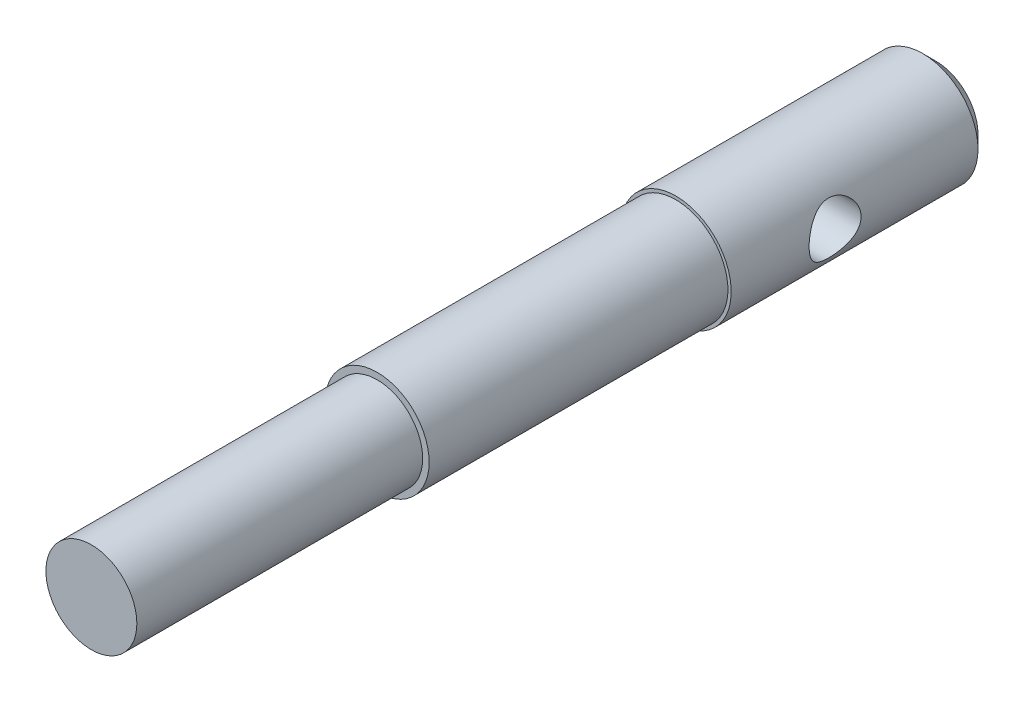
ISO-10303-21;
HEADER;
FILE_DESCRIPTION(('STEP AP214'),'2;1');
FILE_NAME('part.step','',(''),(''),'','','');
FILE_SCHEMA(('AUTOMOTIVE_DESIGN { 1 0 10303 214 1 1 1 1 }'));
ENDSEC;
DATA;
#1=APPLICATION_CONTEXT('core data for automotive mechanical design processes');
#2=APPLICATION_PROTOCOL_DEFINITION('international standard','automotive_design',2000,#1);
#3=PRODUCT_CONTEXT('',#1,'mechanical');
#4=PRODUCT('Part','Part','',(#3));
#5=PRODUCT_RELATED_PRODUCT_CATEGORY('part','',(#4));
#6=PRODUCT_DEFINITION_FORMATION('','',#4);
#7=PRODUCT_DEFINITION_CONTEXT('part definition',#1,'design');
#8=PRODUCT_DEFINITION('design','',#6,#7);
#9=PRODUCT_DEFINITION_SHAPE('','',#8);
#10=(LENGTH_UNIT() NAMED_UNIT(*) SI_UNIT(.MILLI.,.METRE.));
#11=(NAMED_UNIT(*) PLANE_ANGLE_UNIT() SI_UNIT($,.RADIAN.));
#12=(NAMED_UNIT(*) SI_UNIT($,.STERADIAN.) SOLID_ANGLE_UNIT());
#13=UNCERTAINTY_MEASURE_WITH_UNIT(LENGTH_MEASURE(1.E-05),#10,'distance_accuracy_value','');
#14=(GEOMETRIC_REPRESENTATION_CONTEXT(3) GLOBAL_UNCERTAINTY_ASSIGNED_CONTEXT((#13)) GLOBAL_UNIT_ASSIGNED_CONTEXT((#10,
#11,#12)) REPRESENTATION_CONTEXT('',''));
#15=CARTESIAN_POINT('',(0.,0.,0.));
#16=DIRECTION('',(0.,0.,1.));
#17=DIRECTION('',(1.,0.,0.));
#18=AXIS2_PLACEMENT_3D('',#15,#16,#17);
#19=CARTESIAN_POINT('',(0.,0.,65.));
#20=DIRECTION('',(0.,0.,-1.));
#21=DIRECTION('',(-1.,0.,0.));
#22=AXIS2_PLACEMENT_3D('',#19,#20,#21);
#23=CYLINDRICAL_SURFACE('',#22,4.);
#24=CARTESIAN_POINT('',(0.,0.,20.));
#25=DIRECTION('',(0.,0.,-1.));
#26=DIRECTION('',(-1.,0.,0.));
#27=AXIS2_PLACEMENT_3D('',#24,#25,#26);
#28=CIRCLE('',#27,4.);
#29=CARTESIAN_POINT('',(-4.,0.,20.));
#30=VERTEX_POINT('',#29);
#31=EDGE_CURVE('E113',#30,#30,#28,.T.);
#32=ORIENTED_EDGE('',*,*,#31,.F.);
#33=EDGE_LOOP('',(#32));
#34=FACE_BOUND('',#33,.T.);
#35=CARTESIAN_POINT('',(0.,0.,43.));
#36=DIRECTION('',(0.,0.,1.));
#37=DIRECTION('',(1.,0.,0.));
#38=AXIS2_PLACEMENT_3D('',#35,#36,#37);
#39=CIRCLE('',#38,4.);
#40=CARTESIAN_POINT('',(4.,0.,43.));
#41=VERTEX_POINT('',#40);
#42=EDGE_CURVE('E106',#41,#41,#39,.T.);
#43=ORIENTED_EDGE('',*,*,#42,.F.);
#44=EDGE_LOOP('',(#43));
#45=FACE_BOUND('',#44,.T.);
#46=ADVANCED_FACE('F34',(#34,#45),#23,.T.);
#47=CARTESIAN_POINT('',(0.,0.,20.));
#48=DIRECTION('',(0.,0.,-1.));
#49=DIRECTION('',(-1.,0.,0.));
#50=AXIS2_PLACEMENT_3D('',#47,#48,#49);
#51=CYLINDRICAL_SURFACE('',#50,4.25);
#52=CARTESIAN_POINT('',(0.,0.,1.));
#53=DIRECTION('',(0.,0.,1.));
#54=DIRECTION('',(1.,0.,0.));
#55=AXIS2_PLACEMENT_3D('',#52,#53,#54);
#56=CIRCLE('',#55,4.25);
#57=CARTESIAN_POINT('',(4.25,0.,1.));
#58=VERTEX_POINT('',#57);
#59=EDGE_CURVE('E10',#58,#58,#56,.T.);
#60=ORIENTED_EDGE('',*,*,#59,.T.);
#61=EDGE_LOOP('',(#60));
#62=FACE_BOUND('',#61,.T.);
#63=CARTESIAN_POINT('',(-4.25,0.,10.));
#64=CARTESIAN_POINT('',(-4.24999501672173,-0.105871059149561,10.0000059093653));
#65=CARTESIAN_POINT('',(-4.24600055225517,-0.211889826042652,10.0084560386312));
#66=CARTESIAN_POINT('',(-4.23041695023392,-0.420839602880815,10.041904277046));
#67=CARTESIAN_POINT('',(-4.21881125611067,-0.52376336869274,10.0669384623928));
#68=CARTESIAN_POINT('',(-4.18922939752824,-0.723173878337783,10.132384273026));
#69=CARTESIAN_POINT('',(-4.17127698127016,-0.8196830464565,10.1727386142832));
#70=CARTESIAN_POINT('',(-4.13068518172628,-1.0044398223861,10.2674052431119));
#71=CARTESIAN_POINT('',(-4.10804653469598,-1.09268872481146,10.3217153384128));
#72=CARTESIAN_POINT('',(-4.05873967893696,-1.26392455033518,10.4461945540519));
#73=CARTESIAN_POINT('',(-4.03191771501793,-1.3463491186544,10.5170755721965));
#74=CARTESIAN_POINT('',(-3.97782593635649,-1.4986476575487,10.6711645950736));
#75=CARTESIAN_POINT('',(-3.95055583482041,-1.56851321989917,10.7543807906679));
#76=CARTESIAN_POINT('',(-3.89658395161941,-1.69835351712052,10.937452571941));
#77=CARTESIAN_POINT('',(-3.8700409808222,-1.75735961813898,11.0380472339996));
#78=CARTESIAN_POINT('',(-3.82305583598051,-1.85736877238298,11.2491367541356));
#79=CARTESIAN_POINT('',(-3.80260971252858,-1.89838348819139,11.3596251426801));
#80=CARTESIAN_POINT('',(-3.77184300792218,-1.95877454614056,11.5809519010522));
#81=CARTESIAN_POINT('',(-3.7610166353829,-1.97924028051801,11.6914194837833));
#82=CARTESIAN_POINT('',(-3.74931857537696,-2.00132060875908,11.9147086551103));
#83=CARTESIAN_POINT('',(-3.74843891026276,-2.00295030987974,12.0275282844974));
#84=CARTESIAN_POINT('',(-3.75631826072012,-1.98811796191759,12.2398718985763));
#85=CARTESIAN_POINT('',(-3.76409477837728,-1.97350028282984,12.3395694330853));
#86=CARTESIAN_POINT('',(-3.78671111411083,-1.9297458531108,12.5348844561642));
#87=CARTESIAN_POINT('',(-3.80155279217032,-1.90060527906891,12.6305008631041));
#88=CARTESIAN_POINT('',(-3.83696951615222,-1.82806435546186,12.8176111370788));
#89=CARTESIAN_POINT('',(-3.85766925447546,-1.7843497166112,12.9089584616637));
#90=CARTESIAN_POINT('',(-3.90246130874407,-1.68413318492711,13.0834336609369));
#91=CARTESIAN_POINT('',(-3.92655511301628,-1.62762567567576,13.1665579023659));
#92=CARTESIAN_POINT('',(-3.97864984776727,-1.49612006954125,13.3319085171024));
#93=CARTESIAN_POINT('',(-4.00678814741035,-1.41976798693356,13.4130183074401));
#94=CARTESIAN_POINT('',(-4.06160929195891,-1.25436042487161,13.5617148301346));
#95=CARTESIAN_POINT('',(-4.08829158373605,-1.16530016346911,13.6292964488823));
#96=CARTESIAN_POINT('',(-4.13840356403142,-0.972806177325517,13.7513125832832));
#97=CARTESIAN_POINT('',(-4.1616775271474,-0.868964274970257,13.805172127272));
#98=CARTESIAN_POINT('',(-4.20107928024973,-0.652317629183455,13.8942469354826));
#99=CARTESIAN_POINT('',(-4.21721211816308,-0.539519283627297,13.929475373125));
#100=CARTESIAN_POINT('',(-4.23948952533914,-0.317378759960868,13.9776727045469));
#101=CARTESIAN_POINT('',(-4.24630101292144,-0.208427242924979,13.9921320720944));
#102=CARTESIAN_POINT('',(-4.25139549281652,0.0105532669860149,14.002970667439));
#103=CARTESIAN_POINT('',(-4.24968187376304,0.12058181439956,13.999357079029));
#104=CARTESIAN_POINT('',(-4.23832746137203,0.330801977520076,13.9750994026399));
#105=CARTESIAN_POINT('',(-4.22922405189799,0.431159605950265,13.9556095105664));
#106=CARTESIAN_POINT('',(-4.20465241254947,0.627012300933762,13.90188607809));
#107=CARTESIAN_POINT('',(-4.18918344279834,0.722506800789447,13.8676508237946));
#108=CARTESIAN_POINT('',(-4.15272065515054,0.909254403402077,13.7843849220976));
#109=CARTESIAN_POINT('',(-4.13157280164464,1.00028949047903,13.734935090687));
#110=CARTESIAN_POINT('',(-4.08587319946851,1.1730906488888,13.6231028452428));
#111=CARTESIAN_POINT('',(-4.06131995786446,1.25485262612434,13.5607147530576));
#112=CARTESIAN_POINT('',(-4.00866657010795,1.41448599818457,13.4183311097389));
#113=CARTESIAN_POINT('',(-3.98044529244252,1.49136222549231,13.3372622238705));
#114=CARTESIAN_POINT('',(-3.9253787732795,1.63080783287537,13.1631485689818));
#115=CARTESIAN_POINT('',(-3.89853422632136,1.69337004577724,13.07009783681));
#116=CARTESIAN_POINT('',(-3.8484664097083,1.80434150010071,12.8705278274525));
#117=CARTESIAN_POINT('',(-3.82539811391115,1.85219445431859,12.7636571166297));
#118=CARTESIAN_POINT('',(-3.78739128651415,1.92873631372931,12.5419318704199));
#119=CARTESIAN_POINT('',(-3.77244358121594,1.95744685216814,12.4270865100412));
#120=CARTESIAN_POINT('',(-3.7540451191717,1.99248621232382,12.2038999862937));
#121=CARTESIAN_POINT('',(-3.74967203907467,2.0006137895414,12.095917783482));
#122=CARTESIAN_POINT('',(-3.75036628700348,1.99931434789286,11.8801051197088));
#123=CARTESIAN_POINT('',(-3.75543082802164,1.98989251151428,11.7722746233575));
#124=CARTESIAN_POINT('',(-3.7734967694282,1.95539012584309,11.5683259590073));
#125=CARTESIAN_POINT('',(-3.78587157240528,1.931542562584,11.4719373839239));
#126=CARTESIAN_POINT('',(-3.81651263962931,1.87026678165299,11.2845813280229));
#127=CARTESIAN_POINT('',(-3.83478067027888,1.83283449175123,11.1936154822811));
#128=CARTESIAN_POINT('',(-3.87664451375815,1.7426278073447,11.0130323453247));
#129=CARTESIAN_POINT('',(-3.90051385578242,1.68899863532572,10.9239070878004));
#130=CARTESIAN_POINT('',(-3.95033091262379,1.56895109112261,10.7553681140274));
#131=CARTESIAN_POINT('',(-3.97627961040974,1.50252664918307,10.6759590362419));
#132=CARTESIAN_POINT('',(-4.03052625737342,1.35073812492974,10.5206516330844));
#133=CARTESIAN_POINT('',(-4.05879169857362,1.26412938375077,10.4459519953903));
#134=CARTESIAN_POINT('',(-4.11195927658417,1.07869551476585,10.3119543154961));
#135=CARTESIAN_POINT('',(-4.13685979320114,0.979864545572221,10.2526636800547));
#136=CARTESIAN_POINT('',(-4.18048397470693,0.77278854278162,10.151754675378));
#137=CARTESIAN_POINT('',(-4.19923257892042,0.664583824368734,10.1100647521164));
#138=CARTESIAN_POINT('',(-4.22846407633017,0.441729685596168,10.0459697430504));
#139=CARTESIAN_POINT('',(-4.23897144221042,0.32710043774906,10.0235075414703));
#140=CARTESIAN_POINT('',(-4.24649006313174,0.176275280643623,10.0074686868326));
#141=CARTESIAN_POINT('',(-4.2478035716459,0.141096629845224,10.0046710678705));
#142=CARTESIAN_POINT('',(-4.24955938054871,0.0706174666610995,10.0009357189715));
#143=CARTESIAN_POINT('',(-4.25000166234474,0.0353169516908064,9.99999802872693));
#144=CARTESIAN_POINT('',(-4.25,0.,10.));
#145=B_SPLINE_CURVE_WITH_KNOTS('',3,(#63,#64,#65,#66,#67,#68,#69,#70,#71,#72,#73,#74,#75,#76,
#77,#78,#79,#80,#81,#82,#83,#84,#85,#86,#87,#88,#89,#90,#91,#92,#93,#94,#95,#96,#97,#98,#99,
#100,#101,#102,#103,#104,#105,#106,#107,#108,#109,#110,#111,#112,#113,#114,#115,#116,#117,#118,
#119,#120,#121,#122,#123,#124,#125,#126,#127,#128,#129,#130,#131,#132,#133,#134,#135,#136,#137,
#138,#139,#140,#141,#142,#143,#144),.UNSPECIFIED.,.T.,.F.,(4,2,2,2,2,2,2,2,2,2,2,2,2,2,2,2,2,2,
2,2,2,2,2,2,2,2,2,2,2,2,2,2,2,2,2,2,2,2,2,2,4),(0.,0.317468963430246,0.635630812150111,
0.952614546487505,1.26954851713712,1.60404044269807,1.9387554824617,2.29576275046306,
2.65253825187577,2.98920306211506,3.32559783486664,3.62737787265625,3.92923740141478,
4.23808012859152,4.54705870997163,4.89021790169536,5.23350656265288,5.58942136036763,
5.94508416526045,6.27366971121757,6.60212465856391,6.90863067904059,7.21517233514339,
7.53105800854259,7.84708260764276,8.19125513361926,8.53559961499128,8.89170349343039,
9.24740424616268,9.57074097297067,9.89398223089674,10.1928746721075,10.4918567850119,
10.8107230116018,11.1297408745104,11.48153125132,11.8334904143512,12.1840046113164,
12.5334739595793,12.6393744471102,12.7452771946114),.UNSPECIFIED.);
#146=CARTESIAN_POINT('',(-4.25,0.,10.));
#147=VERTEX_POINT('',#146);
#148=EDGE_CURVE('E46',#147,#147,#145,.T.);
#149=ORIENTED_EDGE('',*,*,#148,.F.);
#150=EDGE_LOOP('',(#149));
#151=FACE_BOUND('',#150,.T.);
#152=CARTESIAN_POINT('',(4.25,0.,10.));
#153=CARTESIAN_POINT('',(4.24999501672173,0.105871059149561,10.0000059093653));
#154=CARTESIAN_POINT('',(4.24600055225517,0.211889826042652,10.0084560386312));
#155=CARTESIAN_POINT('',(4.23041695023392,0.420839602880815,10.041904277046));
#156=CARTESIAN_POINT('',(4.21881125611067,0.52376336869274,10.0669384623928));
#157=CARTESIAN_POINT('',(4.18922939752824,0.723173878337783,10.132384273026));
#158=CARTESIAN_POINT('',(4.17127698127016,0.8196830464565,10.1727386142832));
#159=CARTESIAN_POINT('',(4.13068518172628,1.0044398223861,10.2674052431119));
#160=CARTESIAN_POINT('',(4.10804653469598,1.09268872481146,10.3217153384128));
#161=CARTESIAN_POINT('',(4.05873967893696,1.26392455033518,10.4461945540519));
#162=CARTESIAN_POINT('',(4.03191771501793,1.3463491186544,10.5170755721965));
#163=CARTESIAN_POINT('',(3.97782593635649,1.4986476575487,10.6711645950736));
#164=CARTESIAN_POINT('',(3.95055583482041,1.56851321989917,10.7543807906679));
#165=CARTESIAN_POINT('',(3.89658395161941,1.69835351712052,10.937452571941));
#166=CARTESIAN_POINT('',(3.8700409808222,1.75735961813898,11.0380472339996));
#167=CARTESIAN_POINT('',(3.82305583598051,1.85736877238298,11.2491367541356));
#168=CARTESIAN_POINT('',(3.80260971252858,1.89838348819139,11.3596251426801));
#169=CARTESIAN_POINT('',(3.77184300792218,1.95877454614056,11.5809519010522));
#170=CARTESIAN_POINT('',(3.7610166353829,1.97924028051801,11.6914194837833));
#171=CARTESIAN_POINT('',(3.74931857537696,2.00132060875908,11.9147086551103));
#172=CARTESIAN_POINT('',(3.74843891026276,2.00295030987974,12.0275282844974));
#173=CARTESIAN_POINT('',(3.75631826072012,1.98811796191759,12.2398718985763));
#174=CARTESIAN_POINT('',(3.76409477837728,1.97350028282984,12.3395694330853));
#175=CARTESIAN_POINT('',(3.78671111411083,1.9297458531108,12.5348844561642));
#176=CARTESIAN_POINT('',(3.80155279217032,1.90060527906891,12.6305008631041));
#177=CARTESIAN_POINT('',(3.83696951615222,1.82806435546186,12.8176111370788));
#178=CARTESIAN_POINT('',(3.85766925447546,1.7843497166112,12.9089584616637));
#179=CARTESIAN_POINT('',(3.90246130874407,1.68413318492711,13.0834336609369));
#180=CARTESIAN_POINT('',(3.92655511301628,1.62762567567576,13.1665579023659));
#181=CARTESIAN_POINT('',(3.97864984776727,1.49612006954125,13.3319085171024));
#182=CARTESIAN_POINT('',(4.00678814741035,1.41976798693356,13.4130183074401));
#183=CARTESIAN_POINT('',(4.06160929195891,1.25436042487161,13.5617148301346));
#184=CARTESIAN_POINT('',(4.08829158373605,1.16530016346911,13.6292964488823));
#185=CARTESIAN_POINT('',(4.13840356403142,0.972806177325517,13.7513125832832));
#186=CARTESIAN_POINT('',(4.1616775271474,0.868964274970257,13.805172127272));
#187=CARTESIAN_POINT('',(4.20107928024973,0.652317629183455,13.8942469354826));
#188=CARTESIAN_POINT('',(4.21721211816308,0.539519283627297,13.929475373125));
#189=CARTESIAN_POINT('',(4.23948952533914,0.317378759960868,13.9776727045469));
#190=CARTESIAN_POINT('',(4.24630101292144,0.208427242924979,13.9921320720944));
#191=CARTESIAN_POINT('',(4.25139549281652,-0.0105532669860149,14.002970667439));
#192=CARTESIAN_POINT('',(4.24968187376304,-0.12058181439956,13.999357079029));
#193=CARTESIAN_POINT('',(4.23832746137203,-0.330801977520076,13.9750994026399));
#194=CARTESIAN_POINT('',(4.22922405189799,-0.431159605950265,13.9556095105664));
#195=CARTESIAN_POINT('',(4.20465241254947,-0.627012300933762,13.90188607809));
#196=CARTESIAN_POINT('',(4.18918344279834,-0.722506800789447,13.8676508237946));
#197=CARTESIAN_POINT('',(4.15272065515054,-0.909254403402077,13.7843849220976));
#198=CARTESIAN_POINT('',(4.13157280164464,-1.00028949047903,13.734935090687));
#199=CARTESIAN_POINT('',(4.08587319946851,-1.1730906488888,13.6231028452428));
#200=CARTESIAN_POINT('',(4.06131995786446,-1.25485262612434,13.5607147530576));
#201=CARTESIAN_POINT('',(4.00866657010795,-1.41448599818457,13.4183311097389));
#202=CARTESIAN_POINT('',(3.98044529244252,-1.49136222549231,13.3372622238705));
#203=CARTESIAN_POINT('',(3.9253787732795,-1.63080783287537,13.1631485689818));
#204=CARTESIAN_POINT('',(3.89853422632136,-1.69337004577724,13.07009783681));
#205=CARTESIAN_POINT('',(3.8484664097083,-1.80434150010071,12.8705278274525));
#206=CARTESIAN_POINT('',(3.82539811391115,-1.85219445431859,12.7636571166297));
#207=CARTESIAN_POINT('',(3.78739128651415,-1.92873631372931,12.5419318704199));
#208=CARTESIAN_POINT('',(3.77244358121594,-1.95744685216814,12.4270865100412));
#209=CARTESIAN_POINT('',(3.7540451191717,-1.99248621232382,12.2038999862937));
#210=CARTESIAN_POINT('',(3.74967203907467,-2.0006137895414,12.095917783482));
#211=CARTESIAN_POINT('',(3.75036628700348,-1.99931434789286,11.8801051197088));
#212=CARTESIAN_POINT('',(3.75543082802164,-1.98989251151428,11.7722746233575));
#213=CARTESIAN_POINT('',(3.7734967694282,-1.95539012584309,11.5683259590073));
#214=CARTESIAN_POINT('',(3.78587157240528,-1.931542562584,11.4719373839239));
#215=CARTESIAN_POINT('',(3.81651263962931,-1.87026678165299,11.2845813280229));
#216=CARTESIAN_POINT('',(3.83478067027888,-1.83283449175123,11.1936154822811));
#217=CARTESIAN_POINT('',(3.87664451375815,-1.7426278073447,11.0130323453247));
#218=CARTESIAN_POINT('',(3.90051385578242,-1.68899863532572,10.9239070878004));
#219=CARTESIAN_POINT('',(3.95033091262379,-1.56895109112261,10.7553681140274));
#220=CARTESIAN_POINT('',(3.97627961040974,-1.50252664918307,10.6759590362419));
#221=CARTESIAN_POINT('',(4.03052625737342,-1.35073812492974,10.5206516330844));
#222=CARTESIAN_POINT('',(4.05879169857362,-1.26412938375077,10.4459519953903));
#223=CARTESIAN_POINT('',(4.11195927658417,-1.07869551476585,10.3119543154961));
#224=CARTESIAN_POINT('',(4.13685979320114,-0.979864545572221,10.2526636800547));
#225=CARTESIAN_POINT('',(4.18048397470693,-0.77278854278162,10.151754675378));
#226=CARTESIAN_POINT('',(4.19923257892042,-0.664583824368734,10.1100647521164));
#227=CARTESIAN_POINT('',(4.22846407633017,-0.441729685596168,10.0459697430504));
#228=CARTESIAN_POINT('',(4.23897144221042,-0.32710043774906,10.0235075414703));
#229=CARTESIAN_POINT('',(4.24649006313174,-0.176275280643623,10.0074686868326));
#230=CARTESIAN_POINT('',(4.2478035716459,-0.141096629845224,10.0046710678705));
#231=CARTESIAN_POINT('',(4.24955938054871,-0.0706174666610995,10.0009357189715));
#232=CARTESIAN_POINT('',(4.25000166234474,-0.0353169516908064,9.99999802872693));
#233=CARTESIAN_POINT('',(4.25,0.,10.));
#234=B_SPLINE_CURVE_WITH_KNOTS('',3,(#152,#153,#154,#155,#156,#157,#158,#159,#160,#161,#162,
#163,#164,#165,#166,#167,#168,#169,#170,#171,#172,#173,#174,#175,#176,#177,#178,#179,#180,#181,
#182,#183,#184,#185,#186,#187,#188,#189,#190,#191,#192,#193,#194,#195,#196,#197,#198,#199,#200,
#201,#202,#203,#204,#205,#206,#207,#208,#209,#210,#211,#212,#213,#214,#215,#216,#217,#218,#219,
#220,#221,#222,#223,#224,#225,#226,#227,#228,#229,#230,#231,#232,#233),.UNSPECIFIED.,.T.,.F.,(4,
2,2,2,2,2,2,2,2,2,2,2,2,2,2,2,2,2,2,2,2,2,2,2,2,2,2,2,2,2,2,2,2,2,2,2,2,2,2,2,4),(0.,
0.317468963430246,0.635630812150111,0.952614546487505,1.26954851713712,1.60404044269807,
1.9387554824617,2.29576275046306,2.65253825187577,2.98920306211506,3.32559783486664,
3.62737787265625,3.92923740141478,4.23808012859152,4.54705870997163,4.89021790169536,
5.23350656265288,5.58942136036763,5.94508416526045,6.27366971121757,6.60212465856391,
6.90863067904059,7.21517233514339,7.53105800854259,7.84708260764276,8.19125513361926,
8.53559961499128,8.89170349343039,9.24740424616268,9.57074097297067,9.89398223089674,
10.1928746721075,10.4918567850119,10.8107230116018,11.1297408745104,11.48153125132,
11.8334904143512,12.1840046113164,12.5334739595793,12.6393744471102,12.7452771946114),.UNSPECIFIED.);
#235=CARTESIAN_POINT('',(4.25,0.,10.));
#236=VERTEX_POINT('',#235);
#237=EDGE_CURVE('E50',#236,#236,#234,.T.);
#238=ORIENTED_EDGE('',*,*,#237,.F.);
#239=EDGE_LOOP('',(#238));
#240=FACE_BOUND('',#239,.T.);
#241=CARTESIAN_POINT('',(0.,0.,20.));
#242=DIRECTION('',(0.,0.,-1.));
#243=DIRECTION('',(-1.,0.,0.));
#244=AXIS2_PLACEMENT_3D('',#241,#242,#243);
#245=CIRCLE('',#244,4.25);
#246=CARTESIAN_POINT('',(-4.25,0.,20.));
#247=VERTEX_POINT('',#246);
#248=EDGE_CURVE('E111',#247,#247,#245,.T.);
#249=ORIENTED_EDGE('',*,*,#248,.T.);
#250=EDGE_LOOP('',(#249));
#251=FACE_BOUND('',#250,.T.);
#252=ADVANCED_FACE('F62',(#62,#151,#240,#251),#51,.T.);
#253=CARTESIAN_POINT('',(0.,0.,20.));
#254=DIRECTION('',(0.,0.,-1.));
#255=DIRECTION('',(-1.,0.,0.));
#256=AXIS2_PLACEMENT_3D('',#253,#254,#255);
#257=PLANE('',#256);
#258=ORIENTED_EDGE('',*,*,#31,.T.);
#259=EDGE_LOOP('',(#258));
#260=FACE_BOUND('',#259,.T.);
#261=ORIENTED_EDGE('',*,*,#248,.F.);
#262=EDGE_LOOP('',(#261));
#263=FACE_BOUND('',#262,.T.);
#264=ADVANCED_FACE('F74',(#260,#263),#257,.F.);
#265=CARTESIAN_POINT('',(0.,0.,0.));
#266=DIRECTION('',(0.,0.,1.));
#267=DIRECTION('',(1.,0.,0.));
#268=AXIS2_PLACEMENT_3D('',#265,#266,#267);
#269=PLANE('',#268);
#270=CARTESIAN_POINT('',(0.,0.,0.));
#271=DIRECTION('',(0.,0.,1.));
#272=DIRECTION('',(1.,0.,0.));
#273=AXIS2_PLACEMENT_3D('',#270,#271,#272);
#274=CIRCLE('',#273,3.24999999999999);
#275=CARTESIAN_POINT('',(3.24999999999999,0.,0.));
#276=VERTEX_POINT('',#275);
#277=EDGE_CURVE('E42',#276,#276,#274,.F.);
#278=ORIENTED_EDGE('',*,*,#277,.T.);
#279=EDGE_LOOP('',(#278));
#280=FACE_BOUND('',#279,.T.);
#281=ADVANCED_FACE('F70',(#280),#269,.F.);
#282=CARTESIAN_POINT('',(-4.25,0.,12.));
#283=DIRECTION('',(1.,0.,0.));
#284=DIRECTION('',(0.,0.,-1.));
#285=AXIS2_PLACEMENT_3D('',#282,#283,#284);
#286=CYLINDRICAL_SURFACE('',#285,2.);
#287=ORIENTED_EDGE('',*,*,#148,.T.);
#288=EDGE_LOOP('',(#287));
#289=FACE_BOUND('',#288,.T.);
#290=ORIENTED_EDGE('',*,*,#237,.T.);
#291=EDGE_LOOP('',(#290));
#292=FACE_BOUND('',#291,.T.);
#293=ADVANCED_FACE('F66',(#289,#292),#286,.F.);
#294=CARTESIAN_POINT('',(0.,0.,0.));
#295=DIRECTION('',(0.,0.,1.));
#296=DIRECTION('',(1.,0.,0.));
#297=AXIS2_PLACEMENT_3D('',#294,#295,#296);
#298=CONICAL_SURFACE('',#297,3.24999999999999,0.785398163397452);
#299=ORIENTED_EDGE('',*,*,#59,.F.);
#300=EDGE_LOOP('',(#299));
#301=FACE_BOUND('',#300,.T.);
#302=ORIENTED_EDGE('',*,*,#277,.F.);
#303=EDGE_LOOP('',(#302));
#304=FACE_BOUND('',#303,.T.);
#305=ADVANCED_FACE('F37',(#301,#304),#298,.T.);
#306=CARTESIAN_POINT('',(0.,0.,43.));
#307=DIRECTION('',(0.,0.,1.));
#308=DIRECTION('',(1.,0.,0.));
#309=AXIS2_PLACEMENT_3D('',#306,#307,#308);
#310=PLANE('',#309);
#311=CARTESIAN_POINT('',(0.,0.,43.));
#312=DIRECTION('',(0.,0.,1.));
#313=DIRECTION('',(1.,0.,0.));
#314=AXIS2_PLACEMENT_3D('',#311,#312,#313);
#315=CIRCLE('',#314,3.5);
#316=CARTESIAN_POINT('',(3.5,0.,43.));
#317=VERTEX_POINT('',#316);
#318=EDGE_CURVE('E103',#317,#317,#315,.T.);
#319=ORIENTED_EDGE('',*,*,#318,.F.);
#320=EDGE_LOOP('',(#319));
#321=FACE_BOUND('',#320,.T.);
#322=ORIENTED_EDGE('',*,*,#42,.T.);
#323=EDGE_LOOP('',(#322));
#324=FACE_BOUND('',#323,.T.);
#325=ADVANCED_FACE('F72',(#321,#324),#310,.T.);
#326=CARTESIAN_POINT('',(0.,0.,43.));
#327=DIRECTION('',(0.,0.,1.));
#328=DIRECTION('',(1.,0.,0.));
#329=AXIS2_PLACEMENT_3D('',#326,#327,#328);
#330=CYLINDRICAL_SURFACE('',#329,3.5);
#331=ORIENTED_EDGE('',*,*,#318,.T.);
#332=EDGE_LOOP('',(#331));
#333=FACE_BOUND('',#332,.T.);
#334=CARTESIAN_POINT('',(0.,0.,65.));
#335=DIRECTION('',(0.,0.,1.));
#336=DIRECTION('',(1.,0.,0.));
#337=AXIS2_PLACEMENT_3D('',#334,#335,#336);
#338=CIRCLE('',#337,3.5);
#339=CARTESIAN_POINT('',(3.5,0.,65.));
#340=VERTEX_POINT('',#339);
#341=EDGE_CURVE('E101',#340,#340,#338,.T.);
#342=ORIENTED_EDGE('',*,*,#341,.F.);
#343=EDGE_LOOP('',(#342));
#344=FACE_BOUND('',#343,.T.);
#345=ADVANCED_FACE('F93',(#333,#344),#330,.T.);
#346=CARTESIAN_POINT('',(0.,0.,65.));
#347=DIRECTION('',(0.,0.,1.));
#348=DIRECTION('',(1.,0.,0.));
#349=AXIS2_PLACEMENT_3D('',#346,#347,#348);
#350=PLANE('',#349);
#351=ORIENTED_EDGE('',*,*,#341,.T.);
#352=EDGE_LOOP('',(#351));
#353=FACE_BOUND('',#352,.T.);
#354=ADVANCED_FACE('F91',(#353),#350,.T.);
#355=CLOSED_SHELL('',(#46,#252,#264,#281,#293,#305,#325,#345,#354));
#356=MANIFOLD_SOLID_BREP('B2',#355);
#357=ADVANCED_BREP_SHAPE_REPRESENTATION('',(#18,#356),#14);
#358=SHAPE_DEFINITION_REPRESENTATION(#9,#357);
ENDSEC;
END-ISO-10303-21;
